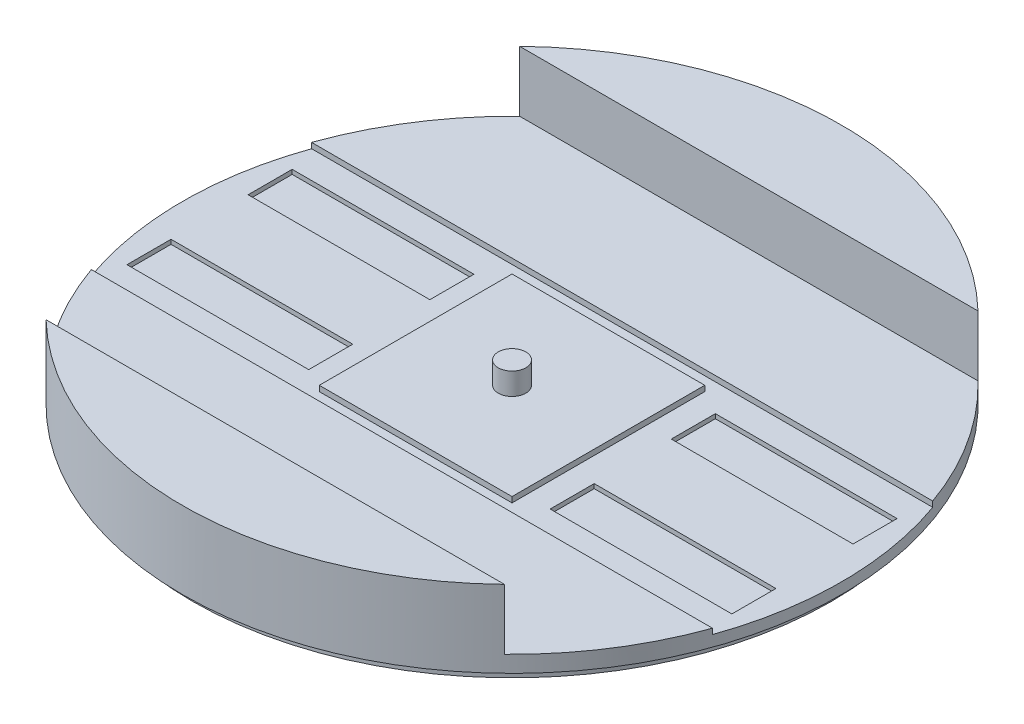
ISO-10303-21;
HEADER;
FILE_DESCRIPTION(('STEP AP214'),'2;1');
FILE_NAME('part.step','',(''),(''),'','','');
FILE_SCHEMA(('AUTOMOTIVE_DESIGN { 1 0 10303 214 1 1 1 1 }'));
ENDSEC;
DATA;
#1=APPLICATION_CONTEXT('core data for automotive mechanical design processes');
#2=APPLICATION_PROTOCOL_DEFINITION('international standard','automotive_design',2000,#1);
#3=PRODUCT_CONTEXT('',#1,'mechanical');
#4=PRODUCT('Part','Part','',(#3));
#5=PRODUCT_RELATED_PRODUCT_CATEGORY('part','',(#4));
#6=PRODUCT_DEFINITION_FORMATION('','',#4);
#7=PRODUCT_DEFINITION_CONTEXT('part definition',#1,'design');
#8=PRODUCT_DEFINITION('design','',#6,#7);
#9=PRODUCT_DEFINITION_SHAPE('','',#8);
#10=(LENGTH_UNIT() NAMED_UNIT(*) SI_UNIT(.MILLI.,.METRE.));
#11=(NAMED_UNIT(*) PLANE_ANGLE_UNIT() SI_UNIT($,.RADIAN.));
#12=(NAMED_UNIT(*) SI_UNIT($,.STERADIAN.) SOLID_ANGLE_UNIT());
#13=UNCERTAINTY_MEASURE_WITH_UNIT(LENGTH_MEASURE(1.E-05),#10,'distance_accuracy_value','');
#14=(GEOMETRIC_REPRESENTATION_CONTEXT(3) GLOBAL_UNCERTAINTY_ASSIGNED_CONTEXT((#13)) GLOBAL_UNIT_ASSIGNED_CONTEXT((#10,
#11,#12)) REPRESENTATION_CONTEXT('',''));
#15=CARTESIAN_POINT('',(0.,0.,0.));
#16=DIRECTION('',(0.,0.,1.));
#17=DIRECTION('',(1.,0.,0.));
#18=AXIS2_PLACEMENT_3D('',#15,#16,#17);
#19=CARTESIAN_POINT('',(-76.,2.54,0.));
#20=DIRECTION('',(0.,1.,0.));
#21=DIRECTION('',(0.,0.,1.));
#22=AXIS2_PLACEMENT_3D('',#19,#20,#21);
#23=PLANE('',#22);
#24=DIRECTION('',(0.,0.,-1.));
#25=VECTOR('',#24,1.);
#26=CARTESIAN_POINT('',(69.7538589904047,2.54,-19.05));
#27=LINE('',#26,#25);
#28=CARTESIAN_POINT('',(69.7538589904047,2.54,-8.88999999999998));
#29=VERTEX_POINT('',#28);
#30=CARTESIAN_POINT('',(69.7538589904047,2.54,-19.05));
#31=VERTEX_POINT('',#30);
#32=EDGE_CURVE('E64',#29,#31,#27,.T.);
#33=ORIENTED_EDGE('',*,*,#32,.F.);
#34=DIRECTION('',(1.,0.,0.));
#35=VECTOR('',#34,1.);
#36=CARTESIAN_POINT('',(69.7538589904047,2.54,-8.88999999999998));
#37=LINE('',#36,#35);
#38=CARTESIAN_POINT('',(27.8438589904047,2.54,-8.89000000000001));
#39=VERTEX_POINT('',#38);
#40=EDGE_CURVE('E329',#39,#29,#37,.T.);
#41=ORIENTED_EDGE('',*,*,#40,.F.);
#42=DIRECTION('',(0.,0.,1.));
#43=VECTOR('',#42,1.);
#44=CARTESIAN_POINT('',(27.8438589904047,2.54,-19.05));
#45=LINE('',#44,#43);
#46=CARTESIAN_POINT('',(27.8438589904047,2.54,-19.05));
#47=VERTEX_POINT('',#46);
#48=EDGE_CURVE('E332',#47,#39,#45,.T.);
#49=ORIENTED_EDGE('',*,*,#48,.F.);
#50=DIRECTION('',(-1.,0.,0.));
#51=VECTOR('',#50,1.);
#52=CARTESIAN_POINT('',(69.7538589904047,2.54,-19.05));
#53=LINE('',#52,#51);
#54=EDGE_CURVE('E336',#31,#47,#53,.T.);
#55=ORIENTED_EDGE('',*,*,#54,.F.);
#56=EDGE_LOOP('',(#33,#41,#49,#55));
#57=FACE_BOUND('',#56,.T.);
#58=DIRECTION('',(1.,0.,0.));
#59=VECTOR('',#58,1.);
#60=CARTESIAN_POINT('',(69.7538589904047,2.54,19.05));
#61=LINE('',#60,#59);
#62=CARTESIAN_POINT('',(27.8438589904047,2.54,19.05));
#63=VERTEX_POINT('',#62);
#64=CARTESIAN_POINT('',(69.7538589904047,2.54,19.05));
#65=VERTEX_POINT('',#64);
#66=EDGE_CURVE('E268',#63,#65,#61,.T.);
#67=ORIENTED_EDGE('',*,*,#66,.F.);
#68=DIRECTION('',(0.,0.,1.));
#69=VECTOR('',#68,1.);
#70=CARTESIAN_POINT('',(27.8438589904047,2.54,19.05));
#71=LINE('',#70,#69);
#72=CARTESIAN_POINT('',(27.8438589904047,2.54,8.89));
#73=VERTEX_POINT('',#72);
#74=EDGE_CURVE('E302',#73,#63,#71,.T.);
#75=ORIENTED_EDGE('',*,*,#74,.F.);
#76=DIRECTION('',(-1.,0.,0.));
#77=VECTOR('',#76,1.);
#78=CARTESIAN_POINT('',(69.7538589904047,2.54,8.89000000000001));
#79=LINE('',#78,#77);
#80=CARTESIAN_POINT('',(69.7538589904047,2.54,8.89000000000001));
#81=VERTEX_POINT('',#80);
#82=EDGE_CURVE('E305',#81,#73,#79,.T.);
#83=ORIENTED_EDGE('',*,*,#82,.F.);
#84=DIRECTION('',(0.,0.,-1.));
#85=VECTOR('',#84,1.);
#86=CARTESIAN_POINT('',(69.7538589904047,2.54,19.05));
#87=LINE('',#86,#85);
#88=EDGE_CURVE('E309',#65,#81,#87,.T.);
#89=ORIENTED_EDGE('',*,*,#88,.F.);
#90=EDGE_LOOP('',(#67,#75,#83,#89));
#91=FACE_BOUND('',#90,.T.);
#92=DIRECTION('',(0.,0.,1.));
#93=VECTOR('',#92,1.);
#94=CARTESIAN_POINT('',(-69.7538589904047,2.54,19.05));
#95=LINE('',#94,#93);
#96=CARTESIAN_POINT('',(-69.7538589904047,2.54,8.88999999999999));
#97=VERTEX_POINT('',#96);
#98=CARTESIAN_POINT('',(-69.7538589904047,2.54,19.05));
#99=VERTEX_POINT('',#98);
#100=EDGE_CURVE('E279',#97,#99,#95,.T.);
#101=ORIENTED_EDGE('',*,*,#100,.F.);
#102=DIRECTION('',(-1.,0.,0.));
#103=VECTOR('',#102,1.);
#104=CARTESIAN_POINT('',(-69.7538589904047,2.54,8.88999999999999));
#105=LINE('',#104,#103);
#106=CARTESIAN_POINT('',(-27.8438589904047,2.54,8.89));
#107=VERTEX_POINT('',#106);
#108=EDGE_CURVE('E269',#107,#97,#105,.T.);
#109=ORIENTED_EDGE('',*,*,#108,.F.);
#110=DIRECTION('',(0.,0.,-1.));
#111=VECTOR('',#110,1.);
#112=CARTESIAN_POINT('',(-27.8438589904047,2.54,19.05));
#113=LINE('',#112,#111);
#114=CARTESIAN_POINT('',(-27.8438589904047,2.54,19.05));
#115=VERTEX_POINT('',#114);
#116=EDGE_CURVE('E272',#115,#107,#113,.T.);
#117=ORIENTED_EDGE('',*,*,#116,.F.);
#118=DIRECTION('',(1.,0.,0.));
#119=VECTOR('',#118,1.);
#120=CARTESIAN_POINT('',(-69.7538589904047,2.54,19.05));
#121=LINE('',#120,#119);
#122=EDGE_CURVE('E276',#99,#115,#121,.T.);
#123=ORIENTED_EDGE('',*,*,#122,.F.);
#124=EDGE_LOOP('',(#101,#109,#117,#123));
#125=FACE_BOUND('',#124,.T.);
#126=DIRECTION('',(0.,0.,1.));
#127=VECTOR('',#126,1.);
#128=CARTESIAN_POINT('',(-69.7538589904047,2.54,-19.05));
#129=LINE('',#128,#127);
#130=CARTESIAN_POINT('',(-69.7538589904047,2.54,-19.05));
#131=VERTEX_POINT('',#130);
#132=CARTESIAN_POINT('',(-69.7538589904047,2.54,-8.89));
#133=VERTEX_POINT('',#132);
#134=EDGE_CURVE('E281',#131,#133,#129,.T.);
#135=ORIENTED_EDGE('',*,*,#134,.F.);
#136=DIRECTION('',(-1.,0.,0.));
#137=VECTOR('',#136,1.);
#138=CARTESIAN_POINT('',(-69.7538589904047,2.54,-19.05));
#139=LINE('',#138,#137);
#140=CARTESIAN_POINT('',(-27.8438589904047,2.54,-19.05));
#141=VERTEX_POINT('',#140);
#142=EDGE_CURVE('E354',#141,#131,#139,.T.);
#143=ORIENTED_EDGE('',*,*,#142,.F.);
#144=DIRECTION('',(0.,0.,-1.));
#145=VECTOR('',#144,1.);
#146=CARTESIAN_POINT('',(-27.8438589904047,2.54,-19.05));
#147=LINE('',#146,#145);
#148=CARTESIAN_POINT('',(-27.8438589904047,2.54,-8.89));
#149=VERTEX_POINT('',#148);
#150=EDGE_CURVE('E368',#149,#141,#147,.T.);
#151=ORIENTED_EDGE('',*,*,#150,.F.);
#152=DIRECTION('',(1.,0.,0.));
#153=VECTOR('',#152,1.);
#154=CARTESIAN_POINT('',(-69.7538589904047,2.54,-8.89));
#155=LINE('',#154,#153);
#156=EDGE_CURVE('E365',#133,#149,#155,.T.);
#157=ORIENTED_EDGE('',*,*,#156,.F.);
#158=EDGE_LOOP('',(#135,#143,#151,#157));
#159=FACE_BOUND('',#158,.T.);
#160=CARTESIAN_POINT('',(0.,2.54,0.));
#161=DIRECTION('',(0.,1.,0.));
#162=DIRECTION('',(0.,0.,1.));
#163=AXIS2_PLACEMENT_3D('',#160,#161,#162);
#164=CIRCLE('',#163,76.);
#165=CARTESIAN_POINT('',(71.6298820325707,2.54,25.4));
#166=VERTEX_POINT('',#165);
#167=CARTESIAN_POINT('',(71.6298820325707,2.54,-25.4));
#168=VERTEX_POINT('',#167);
#169=EDGE_CURVE('E48',#166,#168,#164,.T.);
#170=ORIENTED_EDGE('',*,*,#169,.T.);
#171=DIRECTION('',(-1.,0.,0.));
#172=VECTOR('',#171,1.);
#173=CARTESIAN_POINT('',(25.4,2.54,-25.4));
#174=LINE('',#173,#172);
#175=CARTESIAN_POINT('',(-71.6298820325707,2.54,-25.4));
#176=VERTEX_POINT('',#175);
#177=EDGE_CURVE('E384',#168,#176,#174,.T.);
#178=ORIENTED_EDGE('',*,*,#177,.T.);
#179=CARTESIAN_POINT('',(-71.6298820325707,2.54,25.4));
#180=VERTEX_POINT('',#179);
#181=EDGE_CURVE('E43',#176,#180,#164,.T.);
#182=ORIENTED_EDGE('',*,*,#181,.T.);
#183=DIRECTION('',(1.,0.,0.));
#184=VECTOR('',#183,1.);
#185=CARTESIAN_POINT('',(-76.,2.54,25.4));
#186=LINE('',#185,#184);
#187=EDGE_CURVE('E375',#180,#166,#186,.T.);
#188=ORIENTED_EDGE('',*,*,#187,.T.);
#189=EDGE_LOOP('',(#170,#178,#182,#188));
#190=FACE_BOUND('',#189,.T.);
#191=DIRECTION('',(-1.,0.,0.));
#192=VECTOR('',#191,1.);
#193=CARTESIAN_POINT('',(-22.225,2.54,-22.225));
#194=LINE('',#193,#192);
#195=CARTESIAN_POINT('',(22.225,2.54,-22.225));
#196=VERTEX_POINT('',#195);
#197=CARTESIAN_POINT('',(-22.225,2.54,-22.225));
#198=VERTEX_POINT('',#197);
#199=EDGE_CURVE('E814',#196,#198,#194,.T.);
#200=ORIENTED_EDGE('',*,*,#199,.F.);
#201=DIRECTION('',(0.,0.,-1.));
#202=VECTOR('',#201,1.);
#203=CARTESIAN_POINT('',(22.225,2.54,-22.225));
#204=LINE('',#203,#202);
#205=CARTESIAN_POINT('',(22.225,2.54,22.225));
#206=VERTEX_POINT('',#205);
#207=EDGE_CURVE('E249',#206,#196,#204,.T.);
#208=ORIENTED_EDGE('',*,*,#207,.F.);
#209=DIRECTION('',(1.,0.,0.));
#210=VECTOR('',#209,1.);
#211=CARTESIAN_POINT('',(-22.225,2.54,22.225));
#212=LINE('',#211,#210);
#213=CARTESIAN_POINT('',(-22.225,2.54,22.225));
#214=VERTEX_POINT('',#213);
#215=EDGE_CURVE('E245',#214,#206,#212,.T.);
#216=ORIENTED_EDGE('',*,*,#215,.F.);
#217=DIRECTION('',(0.,0.,1.));
#218=VECTOR('',#217,1.);
#219=CARTESIAN_POINT('',(-22.225,2.54,-22.225));
#220=LINE('',#219,#218);
#221=EDGE_CURVE('E816',#198,#214,#220,.T.);
#222=ORIENTED_EDGE('',*,*,#221,.F.);
#223=EDGE_LOOP('',(#200,#208,#216,#222));
#224=FACE_BOUND('',#223,.T.);
#225=ADVANCED_FACE('F39',(#57,#91,#125,#159,#190,#224),#23,.T.);
#226=CARTESIAN_POINT('',(-76.,3.81,0.));
#227=DIRECTION('',(0.,1.,0.));
#228=DIRECTION('',(0.,0.,1.));
#229=AXIS2_PLACEMENT_3D('',#226,#227,#228);
#230=PLANE('',#229);
#231=DIRECTION('',(-1.,0.,0.));
#232=VECTOR('',#231,1.);
#233=CARTESIAN_POINT('',(-76.,3.81,-25.4));
#234=LINE('',#233,#232);
#235=CARTESIAN_POINT('',(71.6298820325707,3.81,-25.4));
#236=VERTEX_POINT('',#235);
#237=CARTESIAN_POINT('',(-71.6298820325707,3.81,-25.4));
#238=VERTEX_POINT('',#237);
#239=EDGE_CURVE('E435',#236,#238,#234,.T.);
#240=ORIENTED_EDGE('',*,*,#239,.F.);
#241=CARTESIAN_POINT('',(0.,3.81,0.));
#242=DIRECTION('',(0.,1.,0.));
#243=DIRECTION('',(0.,0.,1.));
#244=AXIS2_PLACEMENT_3D('',#241,#242,#243);
#245=CIRCLE('',#244,76.);
#246=CARTESIAN_POINT('',(52.8559164143428,3.81,-54.61));
#247=VERTEX_POINT('',#246);
#248=EDGE_CURVE('E432',#236,#247,#245,.T.);
#249=ORIENTED_EDGE('',*,*,#248,.T.);
#250=DIRECTION('',(-1.,0.,0.));
#251=VECTOR('',#250,1.);
#252=CARTESIAN_POINT('',(-76.,3.81,-54.61));
#253=LINE('',#252,#251);
#254=CARTESIAN_POINT('',(-52.8559164143429,3.81,-54.61));
#255=VERTEX_POINT('',#254);
#256=EDGE_CURVE('E402',#247,#255,#253,.T.);
#257=ORIENTED_EDGE('',*,*,#256,.T.);
#258=EDGE_CURVE('E429',#255,#238,#245,.T.);
#259=ORIENTED_EDGE('',*,*,#258,.T.);
#260=EDGE_LOOP('',(#240,#249,#257,#259));
#261=FACE_BOUND('',#260,.T.);
#262=ADVANCED_FACE('F476',(#261),#230,.T.);
#263=CARTESIAN_POINT('',(0.,17.78,0.));
#264=DIRECTION('',(0.,1.,0.));
#265=DIRECTION('',(0.,0.,1.));
#266=AXIS2_PLACEMENT_3D('',#263,#264,#265);
#267=PLANE('',#266);
#268=DIRECTION('',(-1.,0.,0.));
#269=VECTOR('',#268,1.);
#270=CARTESIAN_POINT('',(0.,17.78,-54.61));
#271=LINE('',#270,#269);
#272=CARTESIAN_POINT('',(52.8559164143429,17.78,-54.61));
#273=VERTEX_POINT('',#272);
#274=CARTESIAN_POINT('',(-52.8559164143429,17.78,-54.61));
#275=VERTEX_POINT('',#274);
#276=EDGE_CURVE('E426',#273,#275,#271,.T.);
#277=ORIENTED_EDGE('',*,*,#276,.F.);
#278=CARTESIAN_POINT('',(0.,17.78,0.));
#279=DIRECTION('',(0.,1.,0.));
#280=DIRECTION('',(0.,0.,1.));
#281=AXIS2_PLACEMENT_3D('',#278,#279,#280);
#282=CIRCLE('',#281,76.);
#283=EDGE_CURVE('E421',#273,#275,#282,.T.);
#284=ORIENTED_EDGE('',*,*,#283,.T.);
#285=EDGE_LOOP('',(#277,#284));
#286=FACE_BOUND('',#285,.T.);
#287=ADVANCED_FACE('F467',(#286),#267,.T.);
#288=CARTESIAN_POINT('',(0.,17.78,0.));
#289=DIRECTION('',(0.,-1.,0.));
#290=DIRECTION('',(0.,0.,-1.));
#291=AXIS2_PLACEMENT_3D('',#288,#289,#290);
#292=CYLINDRICAL_SURFACE('',#291,76.);
#293=ORIENTED_EDGE('',*,*,#248,.F.);
#294=DIRECTION('',(0.,-1.,0.));
#295=VECTOR('',#294,1.);
#296=CARTESIAN_POINT('',(71.6298820325707,17.78,-25.4));
#297=LINE('',#296,#295);
#298=EDGE_CURVE('E396',#236,#168,#297,.T.);
#299=ORIENTED_EDGE('',*,*,#298,.T.);
#300=ORIENTED_EDGE('',*,*,#169,.F.);
#301=DIRECTION('',(0.,-1.,0.));
#302=VECTOR('',#301,1.);
#303=CARTESIAN_POINT('',(71.6298820325707,17.78,25.4));
#304=LINE('',#303,#302);
#305=CARTESIAN_POINT('',(71.6298820325707,3.81,25.4));
#306=VERTEX_POINT('',#305);
#307=EDGE_CURVE('E387',#166,#306,#304,.F.);
#308=ORIENTED_EDGE('',*,*,#307,.T.);
#309=CARTESIAN_POINT('',(52.8559164143429,3.81,54.61));
#310=VERTEX_POINT('',#309);
#311=EDGE_CURVE('E433',#310,#306,#245,.T.);
#312=ORIENTED_EDGE('',*,*,#311,.F.);
#313=DIRECTION('',(0.,-1.,0.));
#314=VECTOR('',#313,1.);
#315=CARTESIAN_POINT('',(52.8559164143429,17.78,54.61));
#316=LINE('',#315,#314);
#317=CARTESIAN_POINT('',(52.8559164143429,17.78,54.61));
#318=VERTEX_POINT('',#317);
#319=EDGE_CURVE('E405',#310,#318,#316,.F.);
#320=ORIENTED_EDGE('',*,*,#319,.T.);
#321=CARTESIAN_POINT('',(-52.8559164143429,17.78,54.61));
#322=VERTEX_POINT('',#321);
#323=EDGE_CURVE('E418',#322,#318,#282,.T.);
#324=ORIENTED_EDGE('',*,*,#323,.F.);
#325=DIRECTION('',(0.,-1.,0.));
#326=VECTOR('',#325,1.);
#327=CARTESIAN_POINT('',(-52.8559164143429,17.78,54.61));
#328=LINE('',#327,#326);
#329=CARTESIAN_POINT('',(-52.8559164143429,3.81,54.61));
#330=VERTEX_POINT('',#329);
#331=EDGE_CURVE('E408',#322,#330,#328,.T.);
#332=ORIENTED_EDGE('',*,*,#331,.T.);
#333=CARTESIAN_POINT('',(-71.6298820325707,3.81,25.4));
#334=VERTEX_POINT('',#333);
#335=EDGE_CURVE('E428',#334,#330,#245,.T.);
#336=ORIENTED_EDGE('',*,*,#335,.F.);
#337=DIRECTION('',(0.,-1.,0.));
#338=VECTOR('',#337,1.);
#339=CARTESIAN_POINT('',(-71.6298820325707,17.78,25.4));
#340=LINE('',#339,#338);
#341=EDGE_CURVE('E390',#334,#180,#340,.T.);
#342=ORIENTED_EDGE('',*,*,#341,.T.);
#343=ORIENTED_EDGE('',*,*,#181,.F.);
#344=DIRECTION('',(0.,-1.,0.));
#345=VECTOR('',#344,1.);
#346=CARTESIAN_POINT('',(-71.6298820325707,17.78,-25.4));
#347=LINE('',#346,#345);
#348=EDGE_CURVE('E393',#176,#238,#347,.F.);
#349=ORIENTED_EDGE('',*,*,#348,.T.);
#350=ORIENTED_EDGE('',*,*,#258,.F.);
#351=DIRECTION('',(0.,-1.,0.));
#352=VECTOR('',#351,1.);
#353=CARTESIAN_POINT('',(-52.8559164143429,17.78,-54.61));
#354=LINE('',#353,#352);
#355=EDGE_CURVE('E411',#255,#275,#354,.F.);
#356=ORIENTED_EDGE('',*,*,#355,.T.);
#357=ORIENTED_EDGE('',*,*,#283,.F.);
#358=DIRECTION('',(0.,-1.,0.));
#359=VECTOR('',#358,1.);
#360=CARTESIAN_POINT('',(52.8559164143428,17.78,-54.61));
#361=LINE('',#360,#359);
#362=EDGE_CURVE('E414',#273,#247,#361,.T.);
#363=ORIENTED_EDGE('',*,*,#362,.T.);
#364=EDGE_LOOP('',(#293,#299,#300,#308,#312,#320,#324,#332,#336,#342,#343,#349,#350,#356,#357,#363));
#365=FACE_BOUND('',#364,.T.);
#366=CARTESIAN_POINT('',(0.,0.,0.));
#367=DIRECTION('',(0.,1.,0.));
#368=DIRECTION('',(0.,0.,1.));
#369=AXIS2_PLACEMENT_3D('',#366,#367,#368);
#370=CIRCLE('',#369,76.);
#371=CARTESIAN_POINT('',(0.,0.,76.));
#372=VERTEX_POINT('',#371);
#373=EDGE_CURVE('E417',#372,#372,#370,.T.);
#374=ORIENTED_EDGE('',*,*,#373,.T.);
#375=EDGE_LOOP('',(#374));
#376=FACE_BOUND('',#375,.T.);
#377=ADVANCED_FACE('F41',(#365,#376),#292,.T.);
#378=DIRECTION('',(1.,0.,0.));
#379=VECTOR('',#378,1.);
#380=CARTESIAN_POINT('',(0.,17.78,54.61));
#381=LINE('',#380,#379);
#382=EDGE_CURVE('E424',#322,#318,#381,.T.);
#383=ORIENTED_EDGE('',*,*,#382,.F.);
#384=ORIENTED_EDGE('',*,*,#323,.T.);
#385=EDGE_LOOP('',(#383,#384));
#386=FACE_BOUND('',#385,.T.);
#387=ADVANCED_FACE('F463',(#386),#267,.T.);
#388=CARTESIAN_POINT('',(0.,0.,0.));
#389=DIRECTION('',(0.,1.,0.));
#390=DIRECTION('',(0.,0.,1.));
#391=AXIS2_PLACEMENT_3D('',#388,#389,#390);
#392=PLANE('',#391);
#393=CARTESIAN_POINT('',(0.,0.,0.));
#394=DIRECTION('',(0.,-1.,0.));
#395=DIRECTION('',(0.,0.,-1.));
#396=AXIS2_PLACEMENT_3D('',#393,#394,#395);
#397=CIRCLE('',#396,73.66);
#398=CARTESIAN_POINT('',(0.,0.,-73.66));
#399=VERTEX_POINT('',#398);
#400=EDGE_CURVE('E11',#399,#399,#397,.T.);
#401=ORIENTED_EDGE('',*,*,#400,.F.);
#402=EDGE_LOOP('',(#401));
#403=FACE_BOUND('',#402,.T.);
#404=ORIENTED_EDGE('',*,*,#373,.F.);
#405=EDGE_LOOP('',(#404));
#406=FACE_BOUND('',#405,.T.);
#407=ADVANCED_FACE('F465',(#403,#406),#392,.F.);
#408=DIRECTION('',(1.,0.,0.));
#409=VECTOR('',#408,1.);
#410=CARTESIAN_POINT('',(-76.,3.81,25.4));
#411=LINE('',#410,#409);
#412=EDGE_CURVE('E434',#334,#306,#411,.T.);
#413=ORIENTED_EDGE('',*,*,#412,.F.);
#414=ORIENTED_EDGE('',*,*,#335,.T.);
#415=DIRECTION('',(1.,0.,0.));
#416=VECTOR('',#415,1.);
#417=CARTESIAN_POINT('',(-76.,3.81,54.61));
#418=LINE('',#417,#416);
#419=EDGE_CURVE('E399',#330,#310,#418,.T.);
#420=ORIENTED_EDGE('',*,*,#419,.T.);
#421=ORIENTED_EDGE('',*,*,#311,.T.);
#422=EDGE_LOOP('',(#413,#414,#420,#421));
#423=FACE_BOUND('',#422,.T.);
#424=ADVANCED_FACE('F456',(#423),#230,.T.);
#425=CARTESIAN_POINT('',(-76.,3.81,-54.61));
#426=DIRECTION('',(0.,0.,-1.));
#427=DIRECTION('',(-1.,0.,0.));
#428=AXIS2_PLACEMENT_3D('',#425,#426,#427);
#429=PLANE('',#428);
#430=ORIENTED_EDGE('',*,*,#276,.T.);
#431=ORIENTED_EDGE('',*,*,#355,.F.);
#432=ORIENTED_EDGE('',*,*,#256,.F.);
#433=ORIENTED_EDGE('',*,*,#362,.F.);
#434=EDGE_LOOP('',(#430,#431,#432,#433));
#435=FACE_BOUND('',#434,.T.);
#436=ADVANCED_FACE('F499',(#435),#429,.F.);
#437=CARTESIAN_POINT('',(-76.,3.81,54.61));
#438=DIRECTION('',(0.,0.,1.));
#439=DIRECTION('',(1.,0.,0.));
#440=AXIS2_PLACEMENT_3D('',#437,#438,#439);
#441=PLANE('',#440);
#442=ORIENTED_EDGE('',*,*,#382,.T.);
#443=ORIENTED_EDGE('',*,*,#319,.F.);
#444=ORIENTED_EDGE('',*,*,#419,.F.);
#445=ORIENTED_EDGE('',*,*,#331,.F.);
#446=EDGE_LOOP('',(#442,#443,#444,#445));
#447=FACE_BOUND('',#446,.T.);
#448=ADVANCED_FACE('F459',(#447),#441,.F.);
#449=CARTESIAN_POINT('',(-76.,2.54,-25.4));
#450=DIRECTION('',(0.,0.,-1.));
#451=DIRECTION('',(-1.,0.,0.));
#452=AXIS2_PLACEMENT_3D('',#449,#450,#451);
#453=PLANE('',#452);
#454=ORIENTED_EDGE('',*,*,#239,.T.);
#455=ORIENTED_EDGE('',*,*,#348,.F.);
#456=ORIENTED_EDGE('',*,*,#177,.F.);
#457=ORIENTED_EDGE('',*,*,#298,.F.);
#458=EDGE_LOOP('',(#454,#455,#456,#457));
#459=FACE_BOUND('',#458,.T.);
#460=ADVANCED_FACE('F445',(#459),#453,.F.);
#461=CARTESIAN_POINT('',(25.4,2.54,25.4));
#462=DIRECTION('',(0.,0.,1.));
#463=DIRECTION('',(1.,0.,0.));
#464=AXIS2_PLACEMENT_3D('',#461,#462,#463);
#465=PLANE('',#464);
#466=ORIENTED_EDGE('',*,*,#412,.T.);
#467=ORIENTED_EDGE('',*,*,#307,.F.);
#468=ORIENTED_EDGE('',*,*,#187,.F.);
#469=ORIENTED_EDGE('',*,*,#341,.F.);
#470=EDGE_LOOP('',(#466,#467,#468,#469));
#471=FACE_BOUND('',#470,.T.);
#472=ADVANCED_FACE('F494',(#471),#465,.F.);
#473=CARTESIAN_POINT('',(-69.7538589904047,1.524,-19.05));
#474=DIRECTION('',(-1.,0.,0.));
#475=DIRECTION('',(0.,0.,1.));
#476=AXIS2_PLACEMENT_3D('',#473,#474,#475);
#477=PLANE('',#476);
#478=ORIENTED_EDGE('',*,*,#134,.T.);
#479=DIRECTION('',(0.,1.,0.));
#480=VECTOR('',#479,1.);
#481=CARTESIAN_POINT('',(-69.7538589904047,1.524,-8.89));
#482=LINE('',#481,#480);
#483=CARTESIAN_POINT('',(-69.7538589904047,1.524,-8.89));
#484=VERTEX_POINT('',#483);
#485=EDGE_CURVE('E363',#484,#133,#482,.T.);
#486=ORIENTED_EDGE('',*,*,#485,.F.);
#487=DIRECTION('',(0.,0.,1.));
#488=VECTOR('',#487,1.);
#489=CARTESIAN_POINT('',(-69.7538589904047,1.524,-19.05));
#490=LINE('',#489,#488);
#491=CARTESIAN_POINT('',(-69.7538589904047,1.524,-19.05));
#492=VERTEX_POINT('',#491);
#493=EDGE_CURVE('E350',#492,#484,#490,.T.);
#494=ORIENTED_EDGE('',*,*,#493,.F.);
#495=DIRECTION('',(0.,1.,0.));
#496=VECTOR('',#495,1.);
#497=CARTESIAN_POINT('',(-69.7538589904047,1.524,-19.05));
#498=LINE('',#497,#496);
#499=EDGE_CURVE('E373',#492,#131,#498,.T.);
#500=ORIENTED_EDGE('',*,*,#499,.T.);
#501=EDGE_LOOP('',(#478,#486,#494,#500));
#502=FACE_BOUND('',#501,.T.);
#503=ADVANCED_FACE('F490',(#502),#477,.F.);
#504=CARTESIAN_POINT('',(-69.7538589904047,1.524,-19.05));
#505=DIRECTION('',(0.,0.,-1.));
#506=DIRECTION('',(-1.,0.,0.));
#507=AXIS2_PLACEMENT_3D('',#504,#505,#506);
#508=PLANE('',#507);
#509=ORIENTED_EDGE('',*,*,#142,.T.);
#510=ORIENTED_EDGE('',*,*,#499,.F.);
#511=DIRECTION('',(-1.,0.,0.));
#512=VECTOR('',#511,1.);
#513=CARTESIAN_POINT('',(-69.7538589904047,1.524,-19.05));
#514=LINE('',#513,#512);
#515=CARTESIAN_POINT('',(-27.8438589904047,1.524,-19.05));
#516=VERTEX_POINT('',#515);
#517=EDGE_CURVE('E360',#516,#492,#514,.T.);
#518=ORIENTED_EDGE('',*,*,#517,.F.);
#519=DIRECTION('',(0.,1.,0.));
#520=VECTOR('',#519,1.);
#521=CARTESIAN_POINT('',(-27.8438589904047,1.524,-19.05));
#522=LINE('',#521,#520);
#523=EDGE_CURVE('E376',#516,#141,#522,.T.);
#524=ORIENTED_EDGE('',*,*,#523,.T.);
#525=EDGE_LOOP('',(#509,#510,#518,#524));
#526=FACE_BOUND('',#525,.T.);
#527=ADVANCED_FACE('F540',(#526),#508,.F.);
#528=CARTESIAN_POINT('',(-27.8438589904047,1.524,-19.05));
#529=DIRECTION('',(1.,0.,0.));
#530=DIRECTION('',(0.,0.,-1.));
#531=AXIS2_PLACEMENT_3D('',#528,#529,#530);
#532=PLANE('',#531);
#533=ORIENTED_EDGE('',*,*,#150,.T.);
#534=ORIENTED_EDGE('',*,*,#523,.F.);
#535=DIRECTION('',(0.,0.,-1.));
#536=VECTOR('',#535,1.);
#537=CARTESIAN_POINT('',(-27.8438589904047,1.524,-19.05));
#538=LINE('',#537,#536);
#539=CARTESIAN_POINT('',(-27.8438589904047,1.524,-8.89));
#540=VERTEX_POINT('',#539);
#541=EDGE_CURVE('E357',#540,#516,#538,.T.);
#542=ORIENTED_EDGE('',*,*,#541,.F.);
#543=DIRECTION('',(0.,1.,0.));
#544=VECTOR('',#543,1.);
#545=CARTESIAN_POINT('',(-27.8438589904047,1.524,-8.89));
#546=LINE('',#545,#544);
#547=EDGE_CURVE('E378',#540,#149,#546,.T.);
#548=ORIENTED_EDGE('',*,*,#547,.T.);
#549=EDGE_LOOP('',(#533,#534,#542,#548));
#550=FACE_BOUND('',#549,.T.);
#551=ADVANCED_FACE('F548',(#550),#532,.F.);
#552=CARTESIAN_POINT('',(-69.7538589904047,1.524,-8.89));
#553=DIRECTION('',(0.,0.,1.));
#554=DIRECTION('',(1.,0.,0.));
#555=AXIS2_PLACEMENT_3D('',#552,#553,#554);
#556=PLANE('',#555);
#557=ORIENTED_EDGE('',*,*,#156,.T.);
#558=ORIENTED_EDGE('',*,*,#547,.F.);
#559=DIRECTION('',(1.,0.,0.));
#560=VECTOR('',#559,1.);
#561=CARTESIAN_POINT('',(-69.7538589904047,1.524,-8.89));
#562=LINE('',#561,#560);
#563=EDGE_CURVE('E353',#484,#540,#562,.T.);
#564=ORIENTED_EDGE('',*,*,#563,.F.);
#565=ORIENTED_EDGE('',*,*,#485,.T.);
#566=EDGE_LOOP('',(#557,#558,#564,#565));
#567=FACE_BOUND('',#566,.T.);
#568=ADVANCED_FACE('F557',(#567),#556,.F.);
#569=CARTESIAN_POINT('',(0.,1.524,0.));
#570=DIRECTION('',(0.,1.,0.));
#571=DIRECTION('',(0.,0.,1.));
#572=AXIS2_PLACEMENT_3D('',#569,#570,#571);
#573=PLANE('',#572);
#574=ORIENTED_EDGE('',*,*,#493,.T.);
#575=ORIENTED_EDGE('',*,*,#563,.T.);
#576=ORIENTED_EDGE('',*,*,#541,.T.);
#577=ORIENTED_EDGE('',*,*,#517,.T.);
#578=EDGE_LOOP('',(#574,#575,#576,#577));
#579=FACE_BOUND('',#578,.T.);
#580=ADVANCED_FACE('F566',(#579),#573,.T.);
#581=CARTESIAN_POINT('',(-69.7538589904047,1.524,19.05));
#582=DIRECTION('',(-1.,0.,0.));
#583=DIRECTION('',(0.,0.,1.));
#584=AXIS2_PLACEMENT_3D('',#581,#582,#583);
#585=PLANE('',#584);
#586=ORIENTED_EDGE('',*,*,#100,.T.);
#587=DIRECTION('',(0.,1.,0.));
#588=VECTOR('',#587,1.);
#589=CARTESIAN_POINT('',(-69.7538589904047,1.524,19.05));
#590=LINE('',#589,#588);
#591=CARTESIAN_POINT('',(-69.7538589904047,1.524,19.05));
#592=VERTEX_POINT('',#591);
#593=EDGE_CURVE('E258',#592,#99,#590,.T.);
#594=ORIENTED_EDGE('',*,*,#593,.F.);
#595=DIRECTION('',(0.,0.,1.));
#596=VECTOR('',#595,1.);
#597=CARTESIAN_POINT('',(-69.7538589904047,1.524,19.05));
#598=LINE('',#597,#596);
#599=CARTESIAN_POINT('',(-69.7538589904047,1.524,8.88999999999999));
#600=VERTEX_POINT('',#599);
#601=EDGE_CURVE('E273',#600,#592,#598,.T.);
#602=ORIENTED_EDGE('',*,*,#601,.F.);
#603=DIRECTION('',(0.,1.,0.));
#604=VECTOR('',#603,1.);
#605=CARTESIAN_POINT('',(-69.7538589904047,1.524,8.88999999999999));
#606=LINE('',#605,#604);
#607=EDGE_CURVE('E266',#600,#97,#606,.T.);
#608=ORIENTED_EDGE('',*,*,#607,.T.);
#609=EDGE_LOOP('',(#586,#594,#602,#608));
#610=FACE_BOUND('',#609,.T.);
#611=ADVANCED_FACE('F574',(#610),#585,.F.);
#612=CARTESIAN_POINT('',(-69.7538589904047,1.524,8.88999999999999));
#613=DIRECTION('',(0.,0.,-1.));
#614=DIRECTION('',(-1.,0.,0.));
#615=AXIS2_PLACEMENT_3D('',#612,#613,#614);
#616=PLANE('',#615);
#617=ORIENTED_EDGE('',*,*,#108,.T.);
#618=ORIENTED_EDGE('',*,*,#607,.F.);
#619=DIRECTION('',(-1.,0.,0.));
#620=VECTOR('',#619,1.);
#621=CARTESIAN_POINT('',(-69.7538589904047,1.524,8.88999999999999));
#622=LINE('',#621,#620);
#623=CARTESIAN_POINT('',(-27.8438589904047,1.524,8.89));
#624=VERTEX_POINT('',#623);
#625=EDGE_CURVE('E261',#624,#600,#622,.T.);
#626=ORIENTED_EDGE('',*,*,#625,.F.);
#627=DIRECTION('',(0.,1.,0.));
#628=VECTOR('',#627,1.);
#629=CARTESIAN_POINT('',(-27.8438589904047,1.524,8.89));
#630=LINE('',#629,#628);
#631=EDGE_CURVE('E264',#624,#107,#630,.T.);
#632=ORIENTED_EDGE('',*,*,#631,.T.);
#633=EDGE_LOOP('',(#617,#618,#626,#632));
#634=FACE_BOUND('',#633,.T.);
#635=ADVANCED_FACE('F583',(#634),#616,.F.);
#636=CARTESIAN_POINT('',(-27.8438589904047,1.524,19.05));
#637=DIRECTION('',(1.,0.,0.));
#638=DIRECTION('',(0.,0.,-1.));
#639=AXIS2_PLACEMENT_3D('',#636,#637,#638);
#640=PLANE('',#639);
#641=ORIENTED_EDGE('',*,*,#116,.T.);
#642=ORIENTED_EDGE('',*,*,#631,.F.);
#643=DIRECTION('',(0.,0.,-1.));
#644=VECTOR('',#643,1.);
#645=CARTESIAN_POINT('',(-27.8438589904047,1.524,19.05));
#646=LINE('',#645,#644);
#647=CARTESIAN_POINT('',(-27.8438589904047,1.524,19.05));
#648=VERTEX_POINT('',#647);
#649=EDGE_CURVE('E284',#648,#624,#646,.T.);
#650=ORIENTED_EDGE('',*,*,#649,.F.);
#651=DIRECTION('',(0.,1.,0.));
#652=VECTOR('',#651,1.);
#653=CARTESIAN_POINT('',(-27.8438589904047,1.524,19.05));
#654=LINE('',#653,#652);
#655=EDGE_CURVE('E262',#648,#115,#654,.T.);
#656=ORIENTED_EDGE('',*,*,#655,.T.);
#657=EDGE_LOOP('',(#641,#642,#650,#656));
#658=FACE_BOUND('',#657,.T.);
#659=ADVANCED_FACE('F592',(#658),#640,.F.);
#660=CARTESIAN_POINT('',(-69.7538589904047,1.524,19.05));
#661=DIRECTION('',(0.,0.,1.));
#662=DIRECTION('',(1.,0.,0.));
#663=AXIS2_PLACEMENT_3D('',#660,#661,#662);
#664=PLANE('',#663);
#665=ORIENTED_EDGE('',*,*,#122,.T.);
#666=ORIENTED_EDGE('',*,*,#655,.F.);
#667=DIRECTION('',(1.,0.,0.));
#668=VECTOR('',#667,1.);
#669=CARTESIAN_POINT('',(-69.7538589904047,1.524,19.05));
#670=LINE('',#669,#668);
#671=EDGE_CURVE('E287',#592,#648,#670,.T.);
#672=ORIENTED_EDGE('',*,*,#671,.F.);
#673=ORIENTED_EDGE('',*,*,#593,.T.);
#674=EDGE_LOOP('',(#665,#666,#672,#673));
#675=FACE_BOUND('',#674,.T.);
#676=ADVANCED_FACE('F601',(#675),#664,.F.);
#677=CARTESIAN_POINT('',(0.,1.524,0.));
#678=DIRECTION('',(0.,-1.,0.));
#679=DIRECTION('',(0.,0.,-1.));
#680=AXIS2_PLACEMENT_3D('',#677,#678,#679);
#681=PLANE('',#680);
#682=ORIENTED_EDGE('',*,*,#601,.T.);
#683=ORIENTED_EDGE('',*,*,#671,.T.);
#684=ORIENTED_EDGE('',*,*,#649,.T.);
#685=ORIENTED_EDGE('',*,*,#625,.T.);
#686=EDGE_LOOP('',(#682,#683,#684,#685));
#687=FACE_BOUND('',#686,.T.);
#688=ADVANCED_FACE('F610',(#687),#681,.F.);
#689=CARTESIAN_POINT('',(69.7538589904047,1.524,19.05));
#690=DIRECTION('',(0.,0.,1.));
#691=DIRECTION('',(1.,0.,0.));
#692=AXIS2_PLACEMENT_3D('',#689,#690,#691);
#693=PLANE('',#692);
#694=ORIENTED_EDGE('',*,*,#66,.T.);
#695=DIRECTION('',(0.,1.,0.));
#696=VECTOR('',#695,1.);
#697=CARTESIAN_POINT('',(69.7538589904047,1.524,19.05));
#698=LINE('',#697,#696);
#699=CARTESIAN_POINT('',(69.7538589904047,1.524,19.05));
#700=VERTEX_POINT('',#699);
#701=EDGE_CURVE('E292',#700,#65,#698,.T.);
#702=ORIENTED_EDGE('',*,*,#701,.F.);
#703=DIRECTION('',(1.,0.,0.));
#704=VECTOR('',#703,1.);
#705=CARTESIAN_POINT('',(69.7538589904047,1.524,19.05));
#706=LINE('',#705,#704);
#707=CARTESIAN_POINT('',(27.8438589904047,1.524,19.05));
#708=VERTEX_POINT('',#707);
#709=EDGE_CURVE('E306',#708,#700,#706,.T.);
#710=ORIENTED_EDGE('',*,*,#709,.F.);
#711=DIRECTION('',(0.,1.,0.));
#712=VECTOR('',#711,1.);
#713=CARTESIAN_POINT('',(27.8438589904047,1.524,19.05));
#714=LINE('',#713,#712);
#715=EDGE_CURVE('E300',#708,#63,#714,.T.);
#716=ORIENTED_EDGE('',*,*,#715,.T.);
#717=EDGE_LOOP('',(#694,#702,#710,#716));
#718=FACE_BOUND('',#717,.T.);
#719=ADVANCED_FACE('F619',(#718),#693,.F.);
#720=CARTESIAN_POINT('',(27.8438589904047,1.524,19.05));
#721=DIRECTION('',(-1.,0.,0.));
#722=DIRECTION('',(0.,0.,1.));
#723=AXIS2_PLACEMENT_3D('',#720,#721,#722);
#724=PLANE('',#723);
#725=ORIENTED_EDGE('',*,*,#74,.T.);
#726=ORIENTED_EDGE('',*,*,#715,.F.);
#727=DIRECTION('',(0.,0.,1.));
#728=VECTOR('',#727,1.);
#729=CARTESIAN_POINT('',(27.8438589904047,1.524,19.05));
#730=LINE('',#729,#728);
#731=CARTESIAN_POINT('',(27.8438589904047,1.524,8.89));
#732=VERTEX_POINT('',#731);
#733=EDGE_CURVE('E295',#732,#708,#730,.T.);
#734=ORIENTED_EDGE('',*,*,#733,.F.);
#735=DIRECTION('',(0.,1.,0.));
#736=VECTOR('',#735,1.);
#737=CARTESIAN_POINT('',(27.8438589904047,1.524,8.89));
#738=LINE('',#737,#736);
#739=EDGE_CURVE('E298',#732,#73,#738,.T.);
#740=ORIENTED_EDGE('',*,*,#739,.T.);
#741=EDGE_LOOP('',(#725,#726,#734,#740));
#742=FACE_BOUND('',#741,.T.);
#743=ADVANCED_FACE('F628',(#742),#724,.F.);
#744=CARTESIAN_POINT('',(69.7538589904047,1.524,8.89000000000001));
#745=DIRECTION('',(0.,0.,-1.));
#746=DIRECTION('',(-1.,0.,0.));
#747=AXIS2_PLACEMENT_3D('',#744,#745,#746);
#748=PLANE('',#747);
#749=ORIENTED_EDGE('',*,*,#82,.T.);
#750=ORIENTED_EDGE('',*,*,#739,.F.);
#751=DIRECTION('',(-1.,0.,0.));
#752=VECTOR('',#751,1.);
#753=CARTESIAN_POINT('',(69.7538589904047,1.524,8.89000000000001));
#754=LINE('',#753,#752);
#755=CARTESIAN_POINT('',(69.7538589904047,1.524,8.89000000000001));
#756=VERTEX_POINT('',#755);
#757=EDGE_CURVE('E315',#756,#732,#754,.T.);
#758=ORIENTED_EDGE('',*,*,#757,.F.);
#759=DIRECTION('',(0.,1.,0.));
#760=VECTOR('',#759,1.);
#761=CARTESIAN_POINT('',(69.7538589904047,1.524,8.89000000000001));
#762=LINE('',#761,#760);
#763=EDGE_CURVE('E296',#756,#81,#762,.T.);
#764=ORIENTED_EDGE('',*,*,#763,.T.);
#765=EDGE_LOOP('',(#749,#750,#758,#764));
#766=FACE_BOUND('',#765,.T.);
#767=ADVANCED_FACE('F637',(#766),#748,.F.);
#768=CARTESIAN_POINT('',(69.7538589904047,1.524,19.05));
#769=DIRECTION('',(1.,0.,0.));
#770=DIRECTION('',(0.,0.,-1.));
#771=AXIS2_PLACEMENT_3D('',#768,#769,#770);
#772=PLANE('',#771);
#773=ORIENTED_EDGE('',*,*,#88,.T.);
#774=ORIENTED_EDGE('',*,*,#763,.F.);
#775=DIRECTION('',(0.,0.,-1.));
#776=VECTOR('',#775,1.);
#777=CARTESIAN_POINT('',(69.7538589904047,1.524,19.05));
#778=LINE('',#777,#776);
#779=EDGE_CURVE('E318',#700,#756,#778,.T.);
#780=ORIENTED_EDGE('',*,*,#779,.F.);
#781=ORIENTED_EDGE('',*,*,#701,.T.);
#782=EDGE_LOOP('',(#773,#774,#780,#781));
#783=FACE_BOUND('',#782,.T.);
#784=ADVANCED_FACE('F646',(#783),#772,.F.);
#785=CARTESIAN_POINT('',(0.,1.524,0.));
#786=DIRECTION('',(0.,-1.,0.));
#787=DIRECTION('',(0.,0.,-1.));
#788=AXIS2_PLACEMENT_3D('',#785,#786,#787);
#789=PLANE('',#788);
#790=ORIENTED_EDGE('',*,*,#709,.T.);
#791=ORIENTED_EDGE('',*,*,#779,.T.);
#792=ORIENTED_EDGE('',*,*,#757,.T.);
#793=ORIENTED_EDGE('',*,*,#733,.T.);
#794=EDGE_LOOP('',(#790,#791,#792,#793));
#795=FACE_BOUND('',#794,.T.);
#796=ADVANCED_FACE('F655',(#795),#789,.F.);
#797=CARTESIAN_POINT('',(69.7538589904047,1.524,-19.05));
#798=DIRECTION('',(1.,0.,0.));
#799=DIRECTION('',(0.,0.,-1.));
#800=AXIS2_PLACEMENT_3D('',#797,#798,#799);
#801=PLANE('',#800);
#802=ORIENTED_EDGE('',*,*,#32,.T.);
#803=DIRECTION('',(0.,1.,0.));
#804=VECTOR('',#803,1.);
#805=CARTESIAN_POINT('',(69.7538589904047,1.524,-19.05));
#806=LINE('',#805,#804);
#807=CARTESIAN_POINT('',(69.7538589904047,1.524,-19.05));
#808=VERTEX_POINT('',#807);
#809=EDGE_CURVE('E323',#808,#31,#806,.T.);
#810=ORIENTED_EDGE('',*,*,#809,.F.);
#811=DIRECTION('',(0.,0.,-1.));
#812=VECTOR('',#811,1.);
#813=CARTESIAN_POINT('',(69.7538589904047,1.524,-19.05));
#814=LINE('',#813,#812);
#815=CARTESIAN_POINT('',(69.7538589904047,1.524,-8.88999999999998));
#816=VERTEX_POINT('',#815);
#817=EDGE_CURVE('E333',#816,#808,#814,.T.);
#818=ORIENTED_EDGE('',*,*,#817,.F.);
#819=DIRECTION('',(0.,1.,0.));
#820=VECTOR('',#819,1.);
#821=CARTESIAN_POINT('',(69.7538589904047,1.524,-8.88999999999998));
#822=LINE('',#821,#820);
#823=EDGE_CURVE('E251',#816,#29,#822,.T.);
#824=ORIENTED_EDGE('',*,*,#823,.T.);
#825=EDGE_LOOP('',(#802,#810,#818,#824));
#826=FACE_BOUND('',#825,.T.);
#827=ADVANCED_FACE('F664',(#826),#801,.F.);
#828=CARTESIAN_POINT('',(69.7538589904047,1.524,-8.88999999999998));
#829=DIRECTION('',(0.,0.,1.));
#830=DIRECTION('',(1.,0.,0.));
#831=AXIS2_PLACEMENT_3D('',#828,#829,#830);
#832=PLANE('',#831);
#833=ORIENTED_EDGE('',*,*,#40,.T.);
#834=ORIENTED_EDGE('',*,*,#823,.F.);
#835=DIRECTION('',(1.,0.,0.));
#836=VECTOR('',#835,1.);
#837=CARTESIAN_POINT('',(69.7538589904047,1.524,-8.88999999999998));
#838=LINE('',#837,#836);
#839=CARTESIAN_POINT('',(27.8438589904047,1.524,-8.89000000000001));
#840=VERTEX_POINT('',#839);
#841=EDGE_CURVE('E325',#840,#816,#838,.T.);
#842=ORIENTED_EDGE('',*,*,#841,.F.);
#843=DIRECTION('',(0.,1.,0.));
#844=VECTOR('',#843,1.);
#845=CARTESIAN_POINT('',(27.8438589904047,1.524,-8.89000000000001));
#846=LINE('',#845,#844);
#847=EDGE_CURVE('E253',#840,#39,#846,.T.);
#848=ORIENTED_EDGE('',*,*,#847,.T.);
#849=EDGE_LOOP('',(#833,#834,#842,#848));
#850=FACE_BOUND('',#849,.T.);
#851=ADVANCED_FACE('F673',(#850),#832,.F.);
#852=CARTESIAN_POINT('',(27.8438589904047,1.524,-19.05));
#853=DIRECTION('',(-1.,0.,0.));
#854=DIRECTION('',(0.,0.,1.));
#855=AXIS2_PLACEMENT_3D('',#852,#853,#854);
#856=PLANE('',#855);
#857=ORIENTED_EDGE('',*,*,#48,.T.);
#858=ORIENTED_EDGE('',*,*,#847,.F.);
#859=DIRECTION('',(0.,0.,1.));
#860=VECTOR('',#859,1.);
#861=CARTESIAN_POINT('',(27.8438589904047,1.524,-19.05));
#862=LINE('',#861,#860);
#863=CARTESIAN_POINT('',(27.8438589904047,1.524,-19.05));
#864=VERTEX_POINT('',#863);
#865=EDGE_CURVE('E342',#864,#840,#862,.T.);
#866=ORIENTED_EDGE('',*,*,#865,.F.);
#867=DIRECTION('',(0.,1.,0.));
#868=VECTOR('',#867,1.);
#869=CARTESIAN_POINT('',(27.8438589904047,1.524,-19.05));
#870=LINE('',#869,#868);
#871=EDGE_CURVE('E326',#864,#47,#870,.T.);
#872=ORIENTED_EDGE('',*,*,#871,.T.);
#873=EDGE_LOOP('',(#857,#858,#866,#872));
#874=FACE_BOUND('',#873,.T.);
#875=ADVANCED_FACE('F681',(#874),#856,.F.);
#876=CARTESIAN_POINT('',(69.7538589904047,1.524,-19.05));
#877=DIRECTION('',(0.,0.,-1.));
#878=DIRECTION('',(-1.,0.,0.));
#879=AXIS2_PLACEMENT_3D('',#876,#877,#878);
#880=PLANE('',#879);
#881=ORIENTED_EDGE('',*,*,#54,.T.);
#882=ORIENTED_EDGE('',*,*,#871,.F.);
#883=DIRECTION('',(-1.,0.,0.));
#884=VECTOR('',#883,1.);
#885=CARTESIAN_POINT('',(69.7538589904047,1.524,-19.05));
#886=LINE('',#885,#884);
#887=EDGE_CURVE('E345',#808,#864,#886,.T.);
#888=ORIENTED_EDGE('',*,*,#887,.F.);
#889=ORIENTED_EDGE('',*,*,#809,.T.);
#890=EDGE_LOOP('',(#881,#882,#888,#889));
#891=FACE_BOUND('',#890,.T.);
#892=ADVANCED_FACE('F690',(#891),#880,.F.);
#893=CARTESIAN_POINT('',(0.,1.524,0.));
#894=DIRECTION('',(0.,-1.,0.));
#895=DIRECTION('',(0.,0.,-1.));
#896=AXIS2_PLACEMENT_3D('',#893,#894,#895);
#897=PLANE('',#896);
#898=ORIENTED_EDGE('',*,*,#817,.T.);
#899=ORIENTED_EDGE('',*,*,#887,.T.);
#900=ORIENTED_EDGE('',*,*,#865,.T.);
#901=ORIENTED_EDGE('',*,*,#841,.T.);
#902=EDGE_LOOP('',(#898,#899,#900,#901));
#903=FACE_BOUND('',#902,.T.);
#904=ADVANCED_FACE('F698',(#903),#897,.F.);
#905=CARTESIAN_POINT('',(22.225,3.81,-22.225));
#906=DIRECTION('',(-1.,0.,0.));
#907=DIRECTION('',(0.,0.,1.));
#908=AXIS2_PLACEMENT_3D('',#905,#906,#907);
#909=PLANE('',#908);
#910=ORIENTED_EDGE('',*,*,#207,.T.);
#911=DIRECTION('',(0.,-1.,0.));
#912=VECTOR('',#911,1.);
#913=CARTESIAN_POINT('',(22.225,3.81,-22.225));
#914=LINE('',#913,#912);
#915=CARTESIAN_POINT('',(22.225,3.81,-22.225));
#916=VERTEX_POINT('',#915);
#917=EDGE_CURVE('E230',#916,#196,#914,.T.);
#918=ORIENTED_EDGE('',*,*,#917,.F.);
#919=DIRECTION('',(0.,0.,-1.));
#920=VECTOR('',#919,1.);
#921=CARTESIAN_POINT('',(22.225,3.81,-22.225));
#922=LINE('',#921,#920);
#923=CARTESIAN_POINT('',(22.225,3.81,22.225));
#924=VERTEX_POINT('',#923);
#925=EDGE_CURVE('E237',#924,#916,#922,.T.);
#926=ORIENTED_EDGE('',*,*,#925,.F.);
#927=DIRECTION('',(0.,-1.,0.));
#928=VECTOR('',#927,1.);
#929=CARTESIAN_POINT('',(22.225,3.81,22.225));
#930=LINE('',#929,#928);
#931=EDGE_CURVE('E812',#924,#206,#930,.T.);
#932=ORIENTED_EDGE('',*,*,#931,.T.);
#933=EDGE_LOOP('',(#910,#918,#926,#932));
#934=FACE_BOUND('',#933,.T.);
#935=ADVANCED_FACE('F247',(#934),#909,.F.);
#936=CARTESIAN_POINT('',(-22.225,3.81,-22.225));
#937=DIRECTION('',(0.,0.,1.));
#938=DIRECTION('',(1.,0.,0.));
#939=AXIS2_PLACEMENT_3D('',#936,#937,#938);
#940=PLANE('',#939);
#941=ORIENTED_EDGE('',*,*,#199,.T.);
#942=DIRECTION('',(0.,-1.,0.));
#943=VECTOR('',#942,1.);
#944=CARTESIAN_POINT('',(-22.225,3.81,-22.225));
#945=LINE('',#944,#943);
#946=CARTESIAN_POINT('',(-22.225,3.81,-22.225));
#947=VERTEX_POINT('',#946);
#948=EDGE_CURVE('E233',#947,#198,#945,.T.);
#949=ORIENTED_EDGE('',*,*,#948,.F.);
#950=DIRECTION('',(-1.,0.,0.));
#951=VECTOR('',#950,1.);
#952=CARTESIAN_POINT('',(-22.225,3.81,-22.225));
#953=LINE('',#952,#951);
#954=EDGE_CURVE('E226',#916,#947,#953,.T.);
#955=ORIENTED_EDGE('',*,*,#954,.F.);
#956=ORIENTED_EDGE('',*,*,#917,.T.);
#957=EDGE_LOOP('',(#941,#949,#955,#956));
#958=FACE_BOUND('',#957,.T.);
#959=ADVANCED_FACE('F228',(#958),#940,.F.);
#960=CARTESIAN_POINT('',(-22.225,3.81,-22.225));
#961=DIRECTION('',(1.,0.,0.));
#962=DIRECTION('',(0.,0.,-1.));
#963=AXIS2_PLACEMENT_3D('',#960,#961,#962);
#964=PLANE('',#963);
#965=ORIENTED_EDGE('',*,*,#221,.T.);
#966=DIRECTION('',(0.,-1.,0.));
#967=VECTOR('',#966,1.);
#968=CARTESIAN_POINT('',(-22.225,3.81,22.225));
#969=LINE('',#968,#967);
#970=CARTESIAN_POINT('',(-22.225,3.81,22.225));
#971=VERTEX_POINT('',#970);
#972=EDGE_CURVE('E56',#971,#214,#969,.T.);
#973=ORIENTED_EDGE('',*,*,#972,.F.);
#974=DIRECTION('',(0.,0.,1.));
#975=VECTOR('',#974,1.);
#976=CARTESIAN_POINT('',(-22.225,3.81,-22.225));
#977=LINE('',#976,#975);
#978=EDGE_CURVE('E236',#947,#971,#977,.T.);
#979=ORIENTED_EDGE('',*,*,#978,.F.);
#980=ORIENTED_EDGE('',*,*,#948,.T.);
#981=EDGE_LOOP('',(#965,#973,#979,#980));
#982=FACE_BOUND('',#981,.T.);
#983=ADVANCED_FACE('F729',(#982),#964,.F.);
#984=CARTESIAN_POINT('',(-22.225,3.81,22.225));
#985=DIRECTION('',(0.,0.,-1.));
#986=DIRECTION('',(-1.,0.,0.));
#987=AXIS2_PLACEMENT_3D('',#984,#985,#986);
#988=PLANE('',#987);
#989=ORIENTED_EDGE('',*,*,#215,.T.);
#990=ORIENTED_EDGE('',*,*,#931,.F.);
#991=DIRECTION('',(1.,0.,0.));
#992=VECTOR('',#991,1.);
#993=CARTESIAN_POINT('',(-22.225,3.81,22.225));
#994=LINE('',#993,#992);
#995=EDGE_CURVE('E241',#971,#924,#994,.T.);
#996=ORIENTED_EDGE('',*,*,#995,.F.);
#997=ORIENTED_EDGE('',*,*,#972,.T.);
#998=EDGE_LOOP('',(#989,#990,#996,#997));
#999=FACE_BOUND('',#998,.T.);
#1000=ADVANCED_FACE('F738',(#999),#988,.F.);
#1001=CARTESIAN_POINT('',(0.,3.81,0.));
#1002=DIRECTION('',(0.,1.,0.));
#1003=DIRECTION('',(0.,0.,1.));
#1004=AXIS2_PLACEMENT_3D('',#1001,#1002,#1003);
#1005=PLANE('',#1004);
#1006=CARTESIAN_POINT('',(0.,3.81,0.));
#1007=DIRECTION('',(0.,1.,0.));
#1008=DIRECTION('',(0.,0.,1.));
#1009=AXIS2_PLACEMENT_3D('',#1006,#1007,#1008);
#1010=CIRCLE('',#1009,3.175);
#1011=CARTESIAN_POINT('',(0.,3.81,3.175));
#1012=VERTEX_POINT('',#1011);
#1013=EDGE_CURVE('E802',#1012,#1012,#1010,.T.);
#1014=ORIENTED_EDGE('',*,*,#1013,.F.);
#1015=EDGE_LOOP('',(#1014));
#1016=FACE_BOUND('',#1015,.T.);
#1017=ORIENTED_EDGE('',*,*,#925,.T.);
#1018=ORIENTED_EDGE('',*,*,#954,.T.);
#1019=ORIENTED_EDGE('',*,*,#978,.T.);
#1020=ORIENTED_EDGE('',*,*,#995,.T.);
#1021=EDGE_LOOP('',(#1017,#1018,#1019,#1020));
#1022=FACE_BOUND('',#1021,.T.);
#1023=ADVANCED_FACE('F240',(#1016,#1022),#1005,.T.);
#1024=CARTESIAN_POINT('',(0.,8.89,0.));
#1025=DIRECTION('',(0.,-1.,0.));
#1026=DIRECTION('',(0.,0.,-1.));
#1027=AXIS2_PLACEMENT_3D('',#1024,#1025,#1026);
#1028=CYLINDRICAL_SURFACE('',#1027,3.175);
#1029=CARTESIAN_POINT('',(0.,8.89,0.));
#1030=DIRECTION('',(0.,1.,0.));
#1031=DIRECTION('',(0.,0.,1.));
#1032=AXIS2_PLACEMENT_3D('',#1029,#1030,#1031);
#1033=CIRCLE('',#1032,3.175);
#1034=CARTESIAN_POINT('',(0.,8.89,3.175));
#1035=VERTEX_POINT('',#1034);
#1036=EDGE_CURVE('E805',#1035,#1035,#1033,.T.);
#1037=ORIENTED_EDGE('',*,*,#1036,.F.);
#1038=EDGE_LOOP('',(#1037));
#1039=FACE_BOUND('',#1038,.T.);
#1040=ORIENTED_EDGE('',*,*,#1013,.T.);
#1041=EDGE_LOOP('',(#1040));
#1042=FACE_BOUND('',#1041,.T.);
#1043=ADVANCED_FACE('F756',(#1039,#1042),#1028,.T.);
#1044=CARTESIAN_POINT('',(0.,8.89,0.));
#1045=DIRECTION('',(0.,1.,0.));
#1046=DIRECTION('',(0.,0.,1.));
#1047=AXIS2_PLACEMENT_3D('',#1044,#1045,#1046);
#1048=PLANE('',#1047);
#1049=ORIENTED_EDGE('',*,*,#1036,.T.);
#1050=EDGE_LOOP('',(#1049));
#1051=FACE_BOUND('',#1050,.T.);
#1052=ADVANCED_FACE('F766',(#1051),#1048,.T.);
#1053=CARTESIAN_POINT('',(0.,-2.54,0.));
#1054=DIRECTION('',(0.,1.,0.));
#1055=DIRECTION('',(0.,0.,1.));
#1056=AXIS2_PLACEMENT_3D('',#1053,#1054,#1055);
#1057=CYLINDRICAL_SURFACE('',#1056,73.66);
#1058=CARTESIAN_POINT('',(0.,-2.54,0.));
#1059=DIRECTION('',(0.,-1.,0.));
#1060=DIRECTION('',(0.,0.,-1.));
#1061=AXIS2_PLACEMENT_3D('',#1058,#1059,#1060);
#1062=CIRCLE('',#1061,73.66);
#1063=CARTESIAN_POINT('',(0.,-2.54,-73.66));
#1064=VERTEX_POINT('',#1063);
#1065=EDGE_CURVE('E801',#1064,#1064,#1062,.T.);
#1066=ORIENTED_EDGE('',*,*,#1065,.F.);
#1067=EDGE_LOOP('',(#1066));
#1068=FACE_BOUND('',#1067,.T.);
#1069=ORIENTED_EDGE('',*,*,#400,.T.);
#1070=EDGE_LOOP('',(#1069));
#1071=FACE_BOUND('',#1070,.T.);
#1072=ADVANCED_FACE('F776',(#1068,#1071),#1057,.T.);
#1073=CARTESIAN_POINT('',(0.,-2.54,0.));
#1074=DIRECTION('',(0.,-1.,0.));
#1075=DIRECTION('',(0.,0.,-1.));
#1076=AXIS2_PLACEMENT_3D('',#1073,#1074,#1075);
#1077=PLANE('',#1076);
#1078=ORIENTED_EDGE('',*,*,#1065,.T.);
#1079=EDGE_LOOP('',(#1078));
#1080=FACE_BOUND('',#1079,.T.);
#1081=ADVANCED_FACE('F786',(#1080),#1077,.T.);
#1082=CLOSED_SHELL('',(#225,#262,#287,#377,#387,#407,#424,#436,#448,#460,#472,#503,#527,#551,
#568,#580,#611,#635,#659,#676,#688,#719,#743,#767,#784,#796,#827,#851,#875,#892,#904,#935,#959,
#983,#1000,#1023,#1043,#1052,#1072,#1081));
#1083=MANIFOLD_SOLID_BREP('B2',#1082);
#1084=ADVANCED_BREP_SHAPE_REPRESENTATION('',(#18,#1083),#14);
#1085=SHAPE_DEFINITION_REPRESENTATION(#9,#1084);
ENDSEC;
END-ISO-10303-21;
